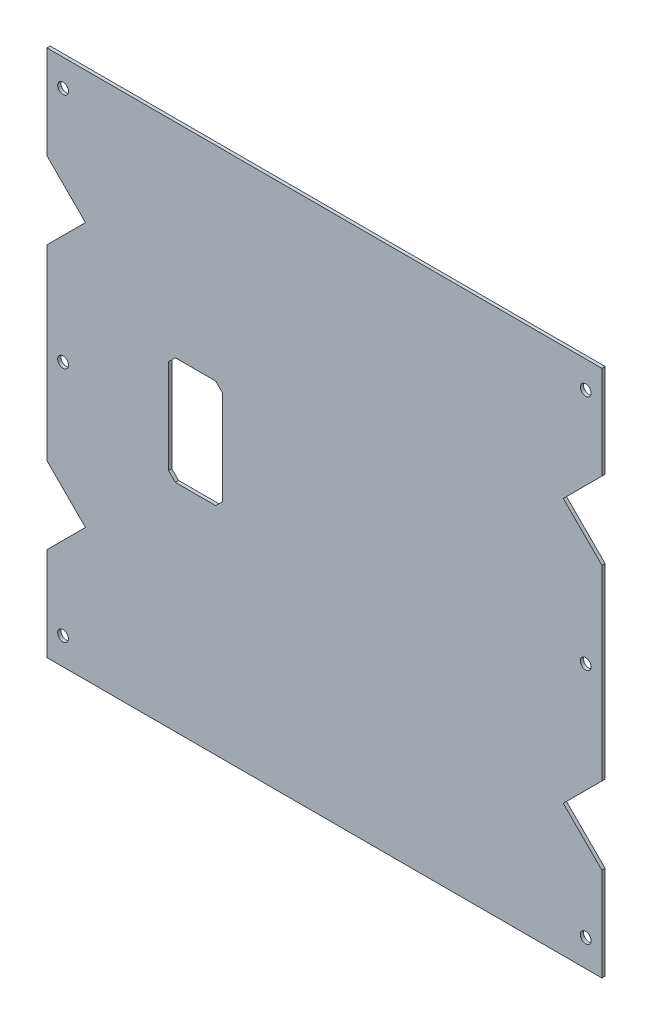
ISO-10303-21;
HEADER;
FILE_DESCRIPTION(('STEP AP214'),'2;1');
FILE_NAME('part.step','',(''),(''),'','','');
FILE_SCHEMA(('AUTOMOTIVE_DESIGN { 1 0 10303 214 1 1 1 1 }'));
ENDSEC;
DATA;
#1=APPLICATION_CONTEXT('core data for automotive mechanical design processes');
#2=APPLICATION_PROTOCOL_DEFINITION('international standard','automotive_design',2000,#1);
#3=PRODUCT_CONTEXT('',#1,'mechanical');
#4=PRODUCT('Part','Part','',(#3));
#5=PRODUCT_RELATED_PRODUCT_CATEGORY('part','',(#4));
#6=PRODUCT_DEFINITION_FORMATION('','',#4);
#7=PRODUCT_DEFINITION_CONTEXT('part definition',#1,'design');
#8=PRODUCT_DEFINITION('design','',#6,#7);
#9=PRODUCT_DEFINITION_SHAPE('','',#8);
#10=(LENGTH_UNIT() NAMED_UNIT(*) SI_UNIT(.MILLI.,.METRE.));
#11=(NAMED_UNIT(*) PLANE_ANGLE_UNIT() SI_UNIT($,.RADIAN.));
#12=(NAMED_UNIT(*) SI_UNIT($,.STERADIAN.) SOLID_ANGLE_UNIT());
#13=UNCERTAINTY_MEASURE_WITH_UNIT(LENGTH_MEASURE(1.E-05),#10,'distance_accuracy_value','');
#14=(GEOMETRIC_REPRESENTATION_CONTEXT(3) GLOBAL_UNCERTAINTY_ASSIGNED_CONTEXT((#13)) GLOBAL_UNIT_ASSIGNED_CONTEXT((#10,
#11,#12)) REPRESENTATION_CONTEXT('',''));
#15=CARTESIAN_POINT('',(0.,0.,0.));
#16=DIRECTION('',(0.,0.,1.));
#17=DIRECTION('',(1.,0.,0.));
#18=AXIS2_PLACEMENT_3D('',#15,#16,#17);
#19=CARTESIAN_POINT('',(0.,0.,-1.2));
#20=DIRECTION('',(0.,0.,1.));
#21=DIRECTION('',(1.,0.,0.));
#22=AXIS2_PLACEMENT_3D('',#19,#20,#21);
#23=PLANE('',#22);
#24=DIRECTION('',(0.707106781186546,0.707106781186549,0.));
#25=VECTOR('',#24,1.);
#26=CARTESIAN_POINT('',(-112.74800186836,24.8232233047034,-1.19999999999988));
#27=LINE('',#26,#25);
#28=CARTESIAN_POINT('',(-102.924778563656,34.6464466094067,-1.19999999999995));
#29=VERTEX_POINT('',#28);
#30=CARTESIAN_POINT('',(-88.6088358912349,48.9623892818283,-1.20000000000005));
#31=VERTEX_POINT('',#30);
#32=EDGE_CURVE('E921',#29,#31,#27,.T.);
#33=ORIENTED_EDGE('',*,*,#32,.T.);
#34=DIRECTION('',(-0.707106781186546,0.707106781186549,0.));
#35=VECTOR('',#34,1.);
#36=CARTESIAN_POINT('',(-112.748001868359,73.1015552589529,-1.19999999999971));
#37=LINE('',#36,#35);
#38=CARTESIAN_POINT('',(-102.924778563656,63.2783319542498,-1.19999999999985));
#39=VERTEX_POINT('',#38);
#40=EDGE_CURVE('E758',#31,#39,#37,.T.);
#41=ORIENTED_EDGE('',*,*,#40,.T.);
#42=DIRECTION('',(0.,1.,0.));
#43=VECTOR('',#42,1.);
#44=CARTESIAN_POINT('',(-102.924778563656,50.1247785636565,-1.19999999999994));
#45=LINE('',#44,#43);
#46=CARTESIAN_POINT('',(-102.924778563656,97.9247785636565,-1.19999999999961));
#47=VERTEX_POINT('',#46);
#48=EDGE_CURVE('E773',#47,#39,#45,.F.);
#49=ORIENTED_EDGE('',*,*,#48,.F.);
#50=DIRECTION('',(1.,0.,0.));
#51=VECTOR('',#50,1.);
#52=CARTESIAN_POINT('',(89.1247785636564,97.9247785636565,-1.19999999999966));
#53=LINE('',#52,#51);
#54=CARTESIAN_POINT('',(102.924778563656,97.9247785636565,-1.19999999999956));
#55=VERTEX_POINT('',#54);
#56=EDGE_CURVE('E794',#55,#47,#53,.F.);
#57=ORIENTED_EDGE('',*,*,#56,.F.);
#58=DIRECTION('',(0.,-1.,0.));
#59=VECTOR('',#58,1.);
#60=CARTESIAN_POINT('',(102.924778563656,97.9247785636565,-1.19999999999956));
#61=LINE('',#60,#59);
#62=CARTESIAN_POINT('',(102.924778563656,63.2783319542498,-1.19999999999981));
#63=VERTEX_POINT('',#62);
#64=EDGE_CURVE('E787',#63,#55,#61,.F.);
#65=ORIENTED_EDGE('',*,*,#64,.F.);
#66=DIRECTION('',(-0.707106781186546,-0.707106781186549,0.));
#67=VECTOR('',#66,1.);
#68=CARTESIAN_POINT('',(112.748001868359,73.1015552589528,-1.19999999999966));
#69=LINE('',#68,#67);
#70=CARTESIAN_POINT('',(88.6088358912349,48.9623892818282,-1.20000000000002));
#71=VERTEX_POINT('',#70);
#72=EDGE_CURVE('E762',#63,#71,#69,.T.);
#73=ORIENTED_EDGE('',*,*,#72,.T.);
#74=DIRECTION('',(0.707106781186547,-0.707106781186549,0.));
#75=VECTOR('',#74,1.);
#76=CARTESIAN_POINT('',(112.74800186836,24.8232233047034,-1.19999999999984));
#77=LINE('',#76,#75);
#78=CARTESIAN_POINT('',(102.924778563656,34.6464466094067,-1.19999999999992));
#79=VERTEX_POINT('',#78);
#80=EDGE_CURVE('E733',#71,#79,#77,.T.);
#81=ORIENTED_EDGE('',*,*,#80,.T.);
#82=DIRECTION('',(0.,-1.,0.));
#83=VECTOR('',#82,1.);
#84=CARTESIAN_POINT('',(102.924778563656,47.8,-1.19999999999991));
#85=LINE('',#84,#83);
#86=CARTESIAN_POINT('',(102.924778563656,-34.6464466094067,-1.1999999999999));
#87=VERTEX_POINT('',#86);
#88=EDGE_CURVE('E811',#87,#79,#85,.F.);
#89=ORIENTED_EDGE('',*,*,#88,.F.);
#90=DIRECTION('',(-0.707106781186546,-0.707106781186549,0.));
#91=VECTOR('',#90,1.);
#92=CARTESIAN_POINT('',(112.74800186836,-24.8232233047034,-1.19999999999985));
#93=LINE('',#92,#91);
#94=CARTESIAN_POINT('',(88.6088358912349,-48.9623892818282,-1.2));
#95=VERTEX_POINT('',#94);
#96=EDGE_CURVE('E728',#87,#95,#93,.T.);
#97=ORIENTED_EDGE('',*,*,#96,.T.);
#98=DIRECTION('',(0.707106781186546,-0.707106781186549,0.));
#99=VECTOR('',#98,1.);
#100=CARTESIAN_POINT('',(112.748001868359,-73.1015552589529,-1.19999999999967));
#101=LINE('',#100,#99);
#102=CARTESIAN_POINT('',(102.924778563656,-63.2783319542498,-1.19999999999982));
#103=VERTEX_POINT('',#102);
#104=EDGE_CURVE('E825',#95,#103,#101,.T.);
#105=ORIENTED_EDGE('',*,*,#104,.T.);
#106=DIRECTION('',(0.,-1.,0.));
#107=VECTOR('',#106,1.);
#108=CARTESIAN_POINT('',(102.924778563656,-50.1247785636564,-1.19999999999991));
#109=LINE('',#108,#107);
#110=CARTESIAN_POINT('',(102.924778563656,-97.9247785636565,-1.19999999999956));
#111=VERTEX_POINT('',#110);
#112=EDGE_CURVE('E833',#111,#103,#109,.F.);
#113=ORIENTED_EDGE('',*,*,#112,.F.);
#114=DIRECTION('',(-1.,0.,0.));
#115=VECTOR('',#114,1.);
#116=CARTESIAN_POINT('',(102.924778563656,-97.9247785636565,-1.19999999999956));
#117=LINE('',#116,#115);
#118=CARTESIAN_POINT('',(-102.924778563656,-97.9247785636565,-1.19999999999955));
#119=VERTEX_POINT('',#118);
#120=EDGE_CURVE('E859',#119,#111,#117,.F.);
#121=ORIENTED_EDGE('',*,*,#120,.F.);
#122=DIRECTION('',(0.,1.,0.));
#123=VECTOR('',#122,1.);
#124=CARTESIAN_POINT('',(-102.924778563656,-97.9247785636565,-1.19999999999955));
#125=LINE('',#124,#123);
#126=CARTESIAN_POINT('',(-102.924778563656,-63.2783319542498,-1.19999999999979));
#127=VERTEX_POINT('',#126);
#128=EDGE_CURVE('E851',#127,#119,#125,.F.);
#129=ORIENTED_EDGE('',*,*,#128,.F.);
#130=DIRECTION('',(0.707106781186546,0.707106781186549,0.));
#131=VECTOR('',#130,1.);
#132=CARTESIAN_POINT('',(-112.748001868359,-73.1015552589528,-1.19999999999965));
#133=LINE('',#132,#131);
#134=CARTESIAN_POINT('',(-88.6088358912349,-48.9623892818282,-1.2));
#135=VERTEX_POINT('',#134);
#136=EDGE_CURVE('E822',#127,#135,#133,.T.);
#137=ORIENTED_EDGE('',*,*,#136,.T.);
#138=DIRECTION('',(-0.707106781186546,0.707106781186549,0.));
#139=VECTOR('',#138,1.);
#140=CARTESIAN_POINT('',(-112.74800186836,-24.8232233047034,-1.19999999999987));
#141=LINE('',#140,#139);
#142=CARTESIAN_POINT('',(-102.924778563656,-34.6464466094067,-1.19999999999992));
#143=VERTEX_POINT('',#142);
#144=EDGE_CURVE('E924',#135,#143,#141,.T.);
#145=ORIENTED_EDGE('',*,*,#144,.T.);
#146=DIRECTION('',(0.,1.,0.));
#147=VECTOR('',#146,1.);
#148=CARTESIAN_POINT('',(-102.924778563656,-47.8,-1.19999999999991));
#149=LINE('',#148,#147);
#150=EDGE_CURVE('E876',#29,#143,#149,.F.);
#151=ORIENTED_EDGE('',*,*,#150,.F.);
#152=EDGE_LOOP('',(#33,#41,#49,#57,#65,#73,#81,#89,#97,#105,#113,#121,#129,#137,#145,#151));
#153=FACE_BOUND('',#152,.T.);
#154=DIRECTION('',(0.,1.,0.));
#155=VECTOR('',#154,1.);
#156=CARTESIAN_POINT('',(-37.8,0.,-1.2));
#157=LINE('',#156,#155);
#158=CARTESIAN_POINT('',(-37.8,-15.3,-1.2));
#159=VERTEX_POINT('',#158);
#160=CARTESIAN_POINT('',(-37.8,19.7,-1.2));
#161=VERTEX_POINT('',#160);
#162=EDGE_CURVE('E552',#159,#161,#157,.T.);
#163=ORIENTED_EDGE('',*,*,#162,.T.);
#164=DIRECTION('',(-0.707106781186548,0.707106781186547,0.));
#165=VECTOR('',#164,1.);
#166=CARTESIAN_POINT('',(-9.04999999999997,-9.04999999999998,-1.2));
#167=LINE('',#166,#165);
#168=CARTESIAN_POINT('',(-40.3,22.2,-1.2));
#169=VERTEX_POINT('',#168);
#170=EDGE_CURVE('E13',#161,#169,#167,.T.);
#171=ORIENTED_EDGE('',*,*,#170,.T.);
#172=DIRECTION('',(-1.,0.,0.));
#173=VECTOR('',#172,1.);
#174=CARTESIAN_POINT('',(0.,22.2,-1.2));
#175=LINE('',#174,#173);
#176=CARTESIAN_POINT('',(-55.3,22.2,-1.2));
#177=VERTEX_POINT('',#176);
#178=EDGE_CURVE('E968',#169,#177,#175,.T.);
#179=ORIENTED_EDGE('',*,*,#178,.T.);
#180=DIRECTION('',(-0.707106781186549,-0.707106781186546,0.));
#181=VECTOR('',#180,1.);
#182=CARTESIAN_POINT('',(-38.7499999999999,38.75,-1.2));
#183=LINE('',#182,#181);
#184=CARTESIAN_POINT('',(-57.8,19.7,-1.2));
#185=VERTEX_POINT('',#184);
#186=EDGE_CURVE('E991',#177,#185,#183,.T.);
#187=ORIENTED_EDGE('',*,*,#186,.T.);
#188=DIRECTION('',(0.,-1.,0.));
#189=VECTOR('',#188,1.);
#190=CARTESIAN_POINT('',(-57.8,0.,-1.2));
#191=LINE('',#190,#189);
#192=CARTESIAN_POINT('',(-57.8,-15.3,-1.2));
#193=VERTEX_POINT('',#192);
#194=EDGE_CURVE('E995',#185,#193,#191,.T.);
#195=ORIENTED_EDGE('',*,*,#194,.T.);
#196=DIRECTION('',(0.707106781186548,-0.707106781186548,0.));
#197=VECTOR('',#196,1.);
#198=CARTESIAN_POINT('',(-36.55,-36.55,-1.2));
#199=LINE('',#198,#197);
#200=CARTESIAN_POINT('',(-55.3,-17.8,-1.2));
#201=VERTEX_POINT('',#200);
#202=EDGE_CURVE('E999',#193,#201,#199,.T.);
#203=ORIENTED_EDGE('',*,*,#202,.T.);
#204=DIRECTION('',(1.,0.,0.));
#205=VECTOR('',#204,1.);
#206=CARTESIAN_POINT('',(0.,-17.8,-1.2));
#207=LINE('',#206,#205);
#208=CARTESIAN_POINT('',(-40.3,-17.8,-1.2));
#209=VERTEX_POINT('',#208);
#210=EDGE_CURVE('E1003',#201,#209,#207,.T.);
#211=ORIENTED_EDGE('',*,*,#210,.T.);
#212=DIRECTION('',(0.707106781186548,0.707106781186548,0.));
#213=VECTOR('',#212,1.);
#214=CARTESIAN_POINT('',(-11.25,11.25,-1.2));
#215=LINE('',#214,#213);
#216=EDGE_CURVE('E1007',#209,#159,#215,.T.);
#217=ORIENTED_EDGE('',*,*,#216,.T.);
#218=EDGE_LOOP('',(#163,#171,#179,#187,#195,#203,#211,#217));
#219=FACE_BOUND('',#218,.T.);
#220=CARTESIAN_POINT('',(-96.924778563657,-1.37574640487224E-13,-1.19999999999998));
#221=DIRECTION('',(0.,0.,-1.));
#222=DIRECTION('',(-1.,0.,0.));
#223=AXIS2_PLACEMENT_3D('',#220,#221,#222);
#224=CIRCLE('',#223,2.);
#225=CARTESIAN_POINT('',(-98.924778563657,-1.3714095961823E-13,-1.19999999999997));
#226=VERTEX_POINT('',#225);
#227=EDGE_CURVE('E928',#226,#226,#224,.T.);
#228=ORIENTED_EDGE('',*,*,#227,.F.);
#229=EDGE_LOOP('',(#228));
#230=FACE_BOUND('',#229,.T.);
#231=CARTESIAN_POINT('',(96.9247785636564,-1.37574640487224E-13,-1.19999999999995));
#232=DIRECTION('',(0.,0.,-1.));
#233=DIRECTION('',(-1.,0.,0.));
#234=AXIS2_PLACEMENT_3D('',#231,#232,#233);
#235=CIRCLE('',#234,2.);
#236=CARTESIAN_POINT('',(94.9247785636564,-1.38008321356218E-13,-1.19999999999996));
#237=VERTEX_POINT('',#236);
#238=EDGE_CURVE('E893',#237,#237,#235,.T.);
#239=ORIENTED_EDGE('',*,*,#238,.F.);
#240=EDGE_LOOP('',(#239));
#241=FACE_BOUND('',#240,.T.);
#242=CARTESIAN_POINT('',(-96.9247785636564,-87.924778563657,-1.19999999999967));
#243=DIRECTION('',(0.,0.,-1.));
#244=DIRECTION('',(-1.,0.,0.));
#245=AXIS2_PLACEMENT_3D('',#242,#243,#244);
#246=CIRCLE('',#245,2.);
#247=CARTESIAN_POINT('',(-98.9247785636564,-87.924778563657,-1.19999999999965));
#248=VERTEX_POINT('',#247);
#249=EDGE_CURVE('E862',#248,#248,#246,.T.);
#250=ORIENTED_EDGE('',*,*,#249,.F.);
#251=EDGE_LOOP('',(#250));
#252=FACE_BOUND('',#251,.T.);
#253=CARTESIAN_POINT('',(96.9247785636564,-87.9247785636565,-1.19999999999965));
#254=DIRECTION('',(0.,0.,-1.));
#255=DIRECTION('',(-1.,0.,0.));
#256=AXIS2_PLACEMENT_3D('',#253,#254,#255);
#257=CIRCLE('',#256,2.);
#258=CARTESIAN_POINT('',(94.9247785636564,-87.9247785636565,-1.19999999999967));
#259=VERTEX_POINT('',#258);
#260=EDGE_CURVE('E753',#259,#259,#257,.T.);
#261=ORIENTED_EDGE('',*,*,#260,.F.);
#262=EDGE_LOOP('',(#261));
#263=FACE_BOUND('',#262,.T.);
#264=CARTESIAN_POINT('',(-96.9247785636566,87.924778563657,-1.19999999999972));
#265=DIRECTION('',(0.,0.,-1.));
#266=DIRECTION('',(1.,0.,0.));
#267=AXIS2_PLACEMENT_3D('',#264,#265,#266);
#268=CIRCLE('',#267,2.);
#269=CARTESIAN_POINT('',(-94.9247785636566,87.9247785636571,-1.19999999999973));
#270=VERTEX_POINT('',#269);
#271=EDGE_CURVE('E790',#270,#270,#268,.T.);
#272=ORIENTED_EDGE('',*,*,#271,.F.);
#273=EDGE_LOOP('',(#272));
#274=FACE_BOUND('',#273,.T.);
#275=CARTESIAN_POINT('',(96.9247785636565,87.9247785636565,-1.19999999999967));
#276=DIRECTION('',(0.,0.,-1.));
#277=DIRECTION('',(1.,0.,0.));
#278=AXIS2_PLACEMENT_3D('',#275,#276,#277);
#279=CIRCLE('',#278,2.);
#280=CARTESIAN_POINT('',(98.9247785636565,87.9247785636565,-1.19999999999965));
#281=VERTEX_POINT('',#280);
#282=EDGE_CURVE('E749',#281,#281,#279,.T.);
#283=ORIENTED_EDGE('',*,*,#282,.F.);
#284=EDGE_LOOP('',(#283));
#285=FACE_BOUND('',#284,.T.);
#286=ADVANCED_FACE('F543',(#153,#219,#230,#241,#252,#263,#274,#285),#23,.F.);
#287=CARTESIAN_POINT('',(0.,0.,0.));
#288=DIRECTION('',(0.,0.,1.));
#289=DIRECTION('',(1.,0.,0.));
#290=AXIS2_PLACEMENT_3D('',#287,#288,#289);
#291=PLANE('',#290);
#292=DIRECTION('',(-0.707106781186546,0.707106781186549,0.));
#293=VECTOR('',#292,1.);
#294=CARTESIAN_POINT('',(-90.1247785636564,50.4783319542497,0.));
#295=LINE('',#294,#293);
#296=CARTESIAN_POINT('',(-88.6088358912349,48.9623892818283,0.));
#297=VERTEX_POINT('',#296);
#298=CARTESIAN_POINT('',(-102.924778563656,63.2783319542498,1.52655665885959E-13));
#299=VERTEX_POINT('',#298);
#300=EDGE_CURVE('E716',#297,#299,#295,.T.);
#301=ORIENTED_EDGE('',*,*,#300,.F.);
#302=DIRECTION('',(0.707106781186546,0.707106781186549,0.));
#303=VECTOR('',#302,1.);
#304=CARTESIAN_POINT('',(-157.837189477156,-20.2659643040926,4.44089209850063E-13));
#305=LINE('',#304,#303);
#306=CARTESIAN_POINT('',(-102.924778563656,34.6464466094067,0.));
#307=VERTEX_POINT('',#306);
#308=EDGE_CURVE('E900',#307,#297,#305,.T.);
#309=ORIENTED_EDGE('',*,*,#308,.F.);
#310=DIRECTION('',(0.,-1.,0.));
#311=VECTOR('',#310,1.);
#312=CARTESIAN_POINT('',(-102.924778563656,0.,0.));
#313=LINE('',#312,#311);
#314=CARTESIAN_POINT('',(-102.924778563656,-34.6464466094067,0.));
#315=VERTEX_POINT('',#314);
#316=EDGE_CURVE('E907',#307,#315,#313,.T.);
#317=ORIENTED_EDGE('',*,*,#316,.T.);
#318=DIRECTION('',(-0.707106781186546,0.707106781186549,0.));
#319=VECTOR('',#318,1.);
#320=CARTESIAN_POINT('',(-90.1247785636564,-47.4464466094067,0.));
#321=LINE('',#320,#319);
#322=CARTESIAN_POINT('',(-88.6088358912349,-48.9623892818282,0.));
#323=VERTEX_POINT('',#322);
#324=EDGE_CURVE('E918',#323,#315,#321,.T.);
#325=ORIENTED_EDGE('',*,*,#324,.F.);
#326=DIRECTION('',(0.707106781186546,0.707106781186549,0.));
#327=VECTOR('',#326,1.);
#328=CARTESIAN_POINT('',(-124.884275797213,-85.2378291878067,5.41233724504764E-13));
#329=LINE('',#328,#327);
#330=CARTESIAN_POINT('',(-102.924778563656,-63.2783319542498,2.15105711021124E-13));
#331=VERTEX_POINT('',#330);
#332=EDGE_CURVE('E815',#331,#323,#329,.T.);
#333=ORIENTED_EDGE('',*,*,#332,.F.);
#334=DIRECTION('',(0.,-1.,0.));
#335=VECTOR('',#334,1.);
#336=CARTESIAN_POINT('',(-102.924778563656,-47.9247785636563,1.04083408558608E-13));
#337=LINE('',#336,#335);
#338=CARTESIAN_POINT('',(-102.924778563656,-97.9247785636565,4.57966997657877E-13));
#339=VERTEX_POINT('',#338);
#340=EDGE_CURVE('E844',#331,#339,#337,.T.);
#341=ORIENTED_EDGE('',*,*,#340,.T.);
#342=DIRECTION('',(1.,0.,0.));
#343=VECTOR('',#342,1.);
#344=CARTESIAN_POINT('',(-137.924778563656,-97.9247785636565,7.21644966006352E-13));
#345=LINE('',#344,#343);
#346=CARTESIAN_POINT('',(102.924778563656,-97.9247785636565,4.44089209850063E-13));
#347=VERTEX_POINT('',#346);
#348=EDGE_CURVE('E841',#339,#347,#345,.T.);
#349=ORIENTED_EDGE('',*,*,#348,.T.);
#350=DIRECTION('',(0.,1.,0.));
#351=VECTOR('',#350,1.);
#352=CARTESIAN_POINT('',(102.924778563656,-47.9247785636563,0.));
#353=LINE('',#352,#351);
#354=CARTESIAN_POINT('',(102.924778563656,-63.2783319542498,1.87350135405495E-13));
#355=VERTEX_POINT('',#354);
#356=EDGE_CURVE('E829',#347,#355,#353,.T.);
#357=ORIENTED_EDGE('',*,*,#356,.T.);
#358=DIRECTION('',(0.707106781186546,-0.707106781186549,0.));
#359=VECTOR('',#358,1.);
#360=CARTESIAN_POINT('',(90.1247785636564,-50.4783319542497,0.));
#361=LINE('',#360,#359);
#362=CARTESIAN_POINT('',(88.6088358912349,-48.9623892818282,0.));
#363=VERTEX_POINT('',#362);
#364=EDGE_CURVE('E812',#363,#355,#361,.T.);
#365=ORIENTED_EDGE('',*,*,#364,.F.);
#366=DIRECTION('',(-0.707106781186546,-0.707106781186549,0.));
#367=VECTOR('',#366,1.);
#368=CARTESIAN_POINT('',(157.837189477156,20.2659643040927,4.71844785465692E-13));
#369=LINE('',#368,#367);
#370=CARTESIAN_POINT('',(102.924778563656,-34.6464466094067,1.11022302462516E-13));
#371=VERTEX_POINT('',#370);
#372=EDGE_CURVE('E873',#371,#363,#369,.T.);
#373=ORIENTED_EDGE('',*,*,#372,.F.);
#374=DIRECTION('',(0.,1.,0.));
#375=VECTOR('',#374,1.);
#376=CARTESIAN_POINT('',(102.924778563656,0.,0.));
#377=LINE('',#376,#375);
#378=CARTESIAN_POINT('',(102.924778563656,34.6464466094067,0.));
#379=VERTEX_POINT('',#378);
#380=EDGE_CURVE('E723',#371,#379,#377,.T.);
#381=ORIENTED_EDGE('',*,*,#380,.T.);
#382=DIRECTION('',(0.707106781186547,-0.707106781186549,0.));
#383=VECTOR('',#382,1.);
#384=CARTESIAN_POINT('',(90.1247785636564,47.4464466094067,0.));
#385=LINE('',#384,#383);
#386=CARTESIAN_POINT('',(88.6088358912349,48.9623892818282,0.));
#387=VERTEX_POINT('',#386);
#388=EDGE_CURVE('E719',#387,#379,#385,.T.);
#389=ORIENTED_EDGE('',*,*,#388,.F.);
#390=DIRECTION('',(-0.707106781186546,-0.707106781186549,0.));
#391=VECTOR('',#390,1.);
#392=CARTESIAN_POINT('',(124.884275797213,85.2378291878067,5.27355936696949E-13));
#393=LINE('',#392,#391);
#394=CARTESIAN_POINT('',(102.924778563656,63.2783319542498,2.0122792321331E-13));
#395=VERTEX_POINT('',#394);
#396=EDGE_CURVE('E706',#395,#387,#393,.T.);
#397=ORIENTED_EDGE('',*,*,#396,.F.);
#398=DIRECTION('',(0.,1.,0.));
#399=VECTOR('',#398,1.);
#400=CARTESIAN_POINT('',(102.924778563656,47.9247785636563,0.));
#401=LINE('',#400,#399);
#402=CARTESIAN_POINT('',(102.924778563656,97.9247785636565,4.44089209850063E-13));
#403=VERTEX_POINT('',#402);
#404=EDGE_CURVE('E784',#395,#403,#401,.T.);
#405=ORIENTED_EDGE('',*,*,#404,.T.);
#406=DIRECTION('',(-1.,0.,0.));
#407=VECTOR('',#406,1.);
#408=CARTESIAN_POINT('',(137.924778563656,97.9247785636565,7.07767178198537E-13));
#409=LINE('',#408,#407);
#410=CARTESIAN_POINT('',(-102.924778563656,97.9247785636565,3.95516952522712E-13));
#411=VERTEX_POINT('',#410);
#412=EDGE_CURVE('E781',#403,#411,#409,.T.);
#413=ORIENTED_EDGE('',*,*,#412,.T.);
#414=DIRECTION('',(0.,-1.,0.));
#415=VECTOR('',#414,1.);
#416=CARTESIAN_POINT('',(-102.924778563656,47.9247785636563,0.));
#417=LINE('',#416,#415);
#418=EDGE_CURVE('E765',#411,#299,#417,.T.);
#419=ORIENTED_EDGE('',*,*,#418,.T.);
#420=EDGE_LOOP('',(#301,#309,#317,#325,#333,#341,#349,#357,#365,#373,#381,#389,#397,#405,#413,#419));
#421=FACE_BOUND('',#420,.T.);
#422=DIRECTION('',(-0.707106781186548,0.707106781186547,0.));
#423=VECTOR('',#422,1.);
#424=CARTESIAN_POINT('',(-37.8,19.7,0.));
#425=LINE('',#424,#423);
#426=CARTESIAN_POINT('',(-37.8,19.7,0.));
#427=VERTEX_POINT('',#426);
#428=CARTESIAN_POINT('',(-40.3,22.2,0.));
#429=VERTEX_POINT('',#428);
#430=EDGE_CURVE('E567',#427,#429,#425,.T.);
#431=ORIENTED_EDGE('',*,*,#430,.F.);
#432=DIRECTION('',(0.,1.,0.));
#433=VECTOR('',#432,1.);
#434=CARTESIAN_POINT('',(-37.8,-15.3,0.));
#435=LINE('',#434,#433);
#436=CARTESIAN_POINT('',(-37.8,-15.3,0.));
#437=VERTEX_POINT('',#436);
#438=EDGE_CURVE('E960',#437,#427,#435,.T.);
#439=ORIENTED_EDGE('',*,*,#438,.F.);
#440=DIRECTION('',(0.707106781186547,0.707106781186547,0.));
#441=VECTOR('',#440,1.);
#442=CARTESIAN_POINT('',(-37.8,-15.3,0.));
#443=LINE('',#442,#441);
#444=CARTESIAN_POINT('',(-40.3,-17.8,0.));
#445=VERTEX_POINT('',#444);
#446=EDGE_CURVE('E956',#445,#437,#443,.T.);
#447=ORIENTED_EDGE('',*,*,#446,.F.);
#448=DIRECTION('',(1.,0.,0.));
#449=VECTOR('',#448,1.);
#450=CARTESIAN_POINT('',(-40.3,-17.8,0.));
#451=LINE('',#450,#449);
#452=CARTESIAN_POINT('',(-55.3,-17.8,0.));
#453=VERTEX_POINT('',#452);
#454=EDGE_CURVE('E952',#453,#445,#451,.T.);
#455=ORIENTED_EDGE('',*,*,#454,.F.);
#456=DIRECTION('',(0.707106781186547,-0.707106781186547,0.));
#457=VECTOR('',#456,1.);
#458=CARTESIAN_POINT('',(-55.3,-17.8,0.));
#459=LINE('',#458,#457);
#460=CARTESIAN_POINT('',(-57.8,-15.3,0.));
#461=VERTEX_POINT('',#460);
#462=EDGE_CURVE('E948',#461,#453,#459,.T.);
#463=ORIENTED_EDGE('',*,*,#462,.F.);
#464=DIRECTION('',(0.,-1.,0.));
#465=VECTOR('',#464,1.);
#466=CARTESIAN_POINT('',(-57.8,-15.3,0.));
#467=LINE('',#466,#465);
#468=CARTESIAN_POINT('',(-57.8,19.7,0.));
#469=VERTEX_POINT('',#468);
#470=EDGE_CURVE('E944',#469,#461,#467,.T.);
#471=ORIENTED_EDGE('',*,*,#470,.F.);
#472=DIRECTION('',(-0.707106781186549,-0.707106781186546,0.));
#473=VECTOR('',#472,1.);
#474=CARTESIAN_POINT('',(-55.3,22.2,0.));
#475=LINE('',#474,#473);
#476=CARTESIAN_POINT('',(-55.3,22.2,0.));
#477=VERTEX_POINT('',#476);
#478=EDGE_CURVE('E940',#477,#469,#475,.T.);
#479=ORIENTED_EDGE('',*,*,#478,.F.);
#480=DIRECTION('',(-1.,0.,0.));
#481=VECTOR('',#480,1.);
#482=CARTESIAN_POINT('',(-40.3,22.2,0.));
#483=LINE('',#482,#481);
#484=EDGE_CURVE('E937',#429,#477,#483,.T.);
#485=ORIENTED_EDGE('',*,*,#484,.F.);
#486=EDGE_LOOP('',(#431,#439,#447,#455,#463,#471,#479,#485));
#487=FACE_BOUND('',#486,.T.);
#488=CARTESIAN_POINT('',(-96.924778563657,-1.37314431965828E-13,0.));
#489=DIRECTION('',(0.,0.,-1.));
#490=DIRECTION('',(-1.,0.,0.));
#491=AXIS2_PLACEMENT_3D('',#488,#489,#490);
#492=CIRCLE('',#491,2.);
#493=CARTESIAN_POINT('',(-98.924778563657,-1.36880751096833E-13,0.));
#494=VERTEX_POINT('',#493);
#495=EDGE_CURVE('E911',#494,#494,#492,.T.);
#496=ORIENTED_EDGE('',*,*,#495,.T.);
#497=EDGE_LOOP('',(#496));
#498=FACE_BOUND('',#497,.T.);
#499=CARTESIAN_POINT('',(96.9247785636564,-1.37314431965827E-13,0.));
#500=DIRECTION('',(0.,0.,1.));
#501=DIRECTION('',(1.,0.,0.));
#502=AXIS2_PLACEMENT_3D('',#499,#500,#501);
#503=CIRCLE('',#502,2.);
#504=CARTESIAN_POINT('',(98.9247785636564,-1.36880751096833E-13,0.));
#505=VERTEX_POINT('',#504);
#506=EDGE_CURVE('E889',#505,#505,#503,.T.);
#507=ORIENTED_EDGE('',*,*,#506,.F.);
#508=EDGE_LOOP('',(#507));
#509=FACE_BOUND('',#508,.T.);
#510=CARTESIAN_POINT('',(96.9247785636564,-87.9247785636565,4.23272528138341E-13));
#511=DIRECTION('',(0.,0.,1.));
#512=DIRECTION('',(0.,-1.,0.));
#513=AXIS2_PLACEMENT_3D('',#510,#511,#512);
#514=CIRCLE('',#513,2.);
#515=CARTESIAN_POINT('',(96.9247785636564,-89.9247785636565,4.43228205505941E-13));
#516=VERTEX_POINT('',#515);
#517=EDGE_CURVE('E866',#516,#516,#514,.T.);
#518=ORIENTED_EDGE('',*,*,#517,.F.);
#519=EDGE_LOOP('',(#518));
#520=FACE_BOUND('',#519,.T.);
#521=CARTESIAN_POINT('',(-96.9247785636564,-87.924778563657,3.40005801291454E-13));
#522=DIRECTION('',(0.,0.,-1.));
#523=DIRECTION('',(-1.,0.,0.));
#524=AXIS2_PLACEMENT_3D('',#521,#522,#523);
#525=CIRCLE('',#524,2.);
#526=CARTESIAN_POINT('',(-98.9247785636564,-87.924778563657,3.55033858350482E-13));
#527=VERTEX_POINT('',#526);
#528=EDGE_CURVE('E847',#527,#527,#525,.T.);
#529=ORIENTED_EDGE('',*,*,#528,.T.);
#530=EDGE_LOOP('',(#529));
#531=FACE_BOUND('',#530,.T.);
#532=CARTESIAN_POINT('',(-96.9247785636566,87.924778563657,2.91433543964104E-13));
#533=DIRECTION('',(0.,0.,-1.));
#534=DIRECTION('',(1.,0.,0.));
#535=AXIS2_PLACEMENT_3D('',#532,#533,#534);
#536=CIRCLE('',#535,2.);
#537=CARTESIAN_POINT('',(-94.9247785636566,87.9247785636571,2.78416760500411E-13));
#538=VERTEX_POINT('',#537);
#539=EDGE_CURVE('E769',#538,#538,#536,.T.);
#540=ORIENTED_EDGE('',*,*,#539,.T.);
#541=EDGE_LOOP('',(#540));
#542=FACE_BOUND('',#541,.T.);
#543=CARTESIAN_POINT('',(96.9247785636565,87.9247785636565,4.09394740330526E-13));
#544=DIRECTION('',(0.,0.,1.));
#545=DIRECTION('',(0.,1.,0.));
#546=AXIS2_PLACEMENT_3D('',#543,#544,#545);
#547=CIRCLE('',#546,2.);
#548=CARTESIAN_POINT('',(96.9247785636565,89.9247785636565,4.29350417698126E-13));
#549=VERTEX_POINT('',#548);
#550=EDGE_CURVE('E801',#549,#549,#547,.T.);
#551=ORIENTED_EDGE('',*,*,#550,.F.);
#552=EDGE_LOOP('',(#551));
#553=FACE_BOUND('',#552,.T.);
#554=ADVANCED_FACE('F545',(#421,#487,#498,#509,#520,#531,#542,#553),#291,.T.);
#555=CARTESIAN_POINT('',(-37.8,19.7,-10.));
#556=DIRECTION('',(0.707106781186547,0.707106781186548,0.));
#557=DIRECTION('',(-0.707106781186548,0.707106781186547,0.));
#558=AXIS2_PLACEMENT_3D('',#555,#556,#557);
#559=PLANE('',#558);
#560=DIRECTION('',(0.,0.,1.));
#561=VECTOR('',#560,1.);
#562=CARTESIAN_POINT('',(-37.8,19.7,-10.));
#563=LINE('',#562,#561);
#564=EDGE_CURVE('E965',#161,#427,#563,.T.);
#565=ORIENTED_EDGE('',*,*,#564,.T.);
#566=ORIENTED_EDGE('',*,*,#430,.T.);
#567=DIRECTION('',(0.,0.,1.));
#568=VECTOR('',#567,1.);
#569=CARTESIAN_POINT('',(-40.3,22.2,-10.));
#570=LINE('',#569,#568);
#571=EDGE_CURVE('E964',#169,#429,#570,.T.);
#572=ORIENTED_EDGE('',*,*,#571,.F.);
#573=ORIENTED_EDGE('',*,*,#170,.F.);
#574=EDGE_LOOP('',(#565,#566,#572,#573));
#575=FACE_BOUND('',#574,.T.);
#576=ADVANCED_FACE('F1029',(#575),#559,.F.);
#577=CARTESIAN_POINT('',(-37.8,-15.3,-10.));
#578=DIRECTION('',(1.,0.,0.));
#579=DIRECTION('',(0.,0.,-1.));
#580=AXIS2_PLACEMENT_3D('',#577,#578,#579);
#581=PLANE('',#580);
#582=DIRECTION('',(0.,0.,1.));
#583=VECTOR('',#582,1.);
#584=CARTESIAN_POINT('',(-37.8,-15.3,-10.));
#585=LINE('',#584,#583);
#586=EDGE_CURVE('E969',#159,#437,#585,.T.);
#587=ORIENTED_EDGE('',*,*,#586,.T.);
#588=ORIENTED_EDGE('',*,*,#438,.T.);
#589=ORIENTED_EDGE('',*,*,#564,.F.);
#590=ORIENTED_EDGE('',*,*,#162,.F.);
#591=EDGE_LOOP('',(#587,#588,#589,#590));
#592=FACE_BOUND('',#591,.T.);
#593=ADVANCED_FACE('F1017',(#592),#581,.F.);
#594=CARTESIAN_POINT('',(-37.8,-15.3,-10.));
#595=DIRECTION('',(0.707106781186548,-0.707106781186548,0.));
#596=DIRECTION('',(0.707106781186548,0.707106781186548,0.));
#597=AXIS2_PLACEMENT_3D('',#594,#595,#596);
#598=PLANE('',#597);
#599=DIRECTION('',(0.,0.,1.));
#600=VECTOR('',#599,1.);
#601=CARTESIAN_POINT('',(-40.3,-17.8,-10.));
#602=LINE('',#601,#600);
#603=EDGE_CURVE('E972',#209,#445,#602,.T.);
#604=ORIENTED_EDGE('',*,*,#603,.T.);
#605=ORIENTED_EDGE('',*,*,#446,.T.);
#606=ORIENTED_EDGE('',*,*,#586,.F.);
#607=ORIENTED_EDGE('',*,*,#216,.F.);
#608=EDGE_LOOP('',(#604,#605,#606,#607));
#609=FACE_BOUND('',#608,.T.);
#610=ADVANCED_FACE('F1019',(#609),#598,.F.);
#611=CARTESIAN_POINT('',(-40.3,-17.8,-10.));
#612=DIRECTION('',(0.,-1.,0.));
#613=DIRECTION('',(1.,0.,0.));
#614=AXIS2_PLACEMENT_3D('',#611,#612,#613);
#615=PLANE('',#614);
#616=DIRECTION('',(0.,0.,1.));
#617=VECTOR('',#616,1.);
#618=CARTESIAN_POINT('',(-55.3,-17.8,-10.));
#619=LINE('',#618,#617);
#620=EDGE_CURVE('E975',#201,#453,#619,.T.);
#621=ORIENTED_EDGE('',*,*,#620,.T.);
#622=ORIENTED_EDGE('',*,*,#454,.T.);
#623=ORIENTED_EDGE('',*,*,#603,.F.);
#624=ORIENTED_EDGE('',*,*,#210,.F.);
#625=EDGE_LOOP('',(#621,#622,#623,#624));
#626=FACE_BOUND('',#625,.T.);
#627=ADVANCED_FACE('F1140',(#626),#615,.F.);
#628=CARTESIAN_POINT('',(-55.3,-17.8,-10.));
#629=DIRECTION('',(-0.707106781186548,-0.707106781186548,0.));
#630=DIRECTION('',(0.707106781186548,-0.707106781186548,0.));
#631=AXIS2_PLACEMENT_3D('',#628,#629,#630);
#632=PLANE('',#631);
#633=DIRECTION('',(0.,0.,1.));
#634=VECTOR('',#633,1.);
#635=CARTESIAN_POINT('',(-57.8,-15.3,-10.));
#636=LINE('',#635,#634);
#637=EDGE_CURVE('E978',#193,#461,#636,.T.);
#638=ORIENTED_EDGE('',*,*,#637,.T.);
#639=ORIENTED_EDGE('',*,*,#462,.T.);
#640=ORIENTED_EDGE('',*,*,#620,.F.);
#641=ORIENTED_EDGE('',*,*,#202,.F.);
#642=EDGE_LOOP('',(#638,#639,#640,#641));
#643=FACE_BOUND('',#642,.T.);
#644=ADVANCED_FACE('F1143',(#643),#632,.F.);
#645=CARTESIAN_POINT('',(-57.8,-15.3,-10.));
#646=DIRECTION('',(-1.,0.,0.));
#647=DIRECTION('',(0.,0.,1.));
#648=AXIS2_PLACEMENT_3D('',#645,#646,#647);
#649=PLANE('',#648);
#650=DIRECTION('',(0.,0.,1.));
#651=VECTOR('',#650,1.);
#652=CARTESIAN_POINT('',(-57.8,19.7,-10.));
#653=LINE('',#652,#651);
#654=EDGE_CURVE('E981',#185,#469,#653,.T.);
#655=ORIENTED_EDGE('',*,*,#654,.T.);
#656=ORIENTED_EDGE('',*,*,#470,.T.);
#657=ORIENTED_EDGE('',*,*,#637,.F.);
#658=ORIENTED_EDGE('',*,*,#194,.F.);
#659=EDGE_LOOP('',(#655,#656,#657,#658));
#660=FACE_BOUND('',#659,.T.);
#661=ADVANCED_FACE('F1147',(#660),#649,.F.);
#662=CARTESIAN_POINT('',(-55.3,22.2,-10.));
#663=DIRECTION('',(-0.707106781186546,0.707106781186549,0.));
#664=DIRECTION('',(-0.707106781186549,-0.707106781186546,0.));
#665=AXIS2_PLACEMENT_3D('',#662,#663,#664);
#666=PLANE('',#665);
#667=DIRECTION('',(0.,0.,1.));
#668=VECTOR('',#667,1.);
#669=CARTESIAN_POINT('',(-55.3,22.2,-10.));
#670=LINE('',#669,#668);
#671=EDGE_CURVE('E559',#177,#477,#670,.T.);
#672=ORIENTED_EDGE('',*,*,#671,.T.);
#673=ORIENTED_EDGE('',*,*,#478,.T.);
#674=ORIENTED_EDGE('',*,*,#654,.F.);
#675=ORIENTED_EDGE('',*,*,#186,.F.);
#676=EDGE_LOOP('',(#672,#673,#674,#675));
#677=FACE_BOUND('',#676,.T.);
#678=ADVANCED_FACE('F1151',(#677),#666,.F.);
#679=CARTESIAN_POINT('',(-40.3,22.2,-10.));
#680=DIRECTION('',(0.,1.,0.));
#681=DIRECTION('',(-1.,0.,0.));
#682=AXIS2_PLACEMENT_3D('',#679,#680,#681);
#683=PLANE('',#682);
#684=ORIENTED_EDGE('',*,*,#571,.T.);
#685=ORIENTED_EDGE('',*,*,#484,.T.);
#686=ORIENTED_EDGE('',*,*,#671,.F.);
#687=ORIENTED_EDGE('',*,*,#178,.F.);
#688=EDGE_LOOP('',(#684,#685,#686,#687));
#689=FACE_BOUND('',#688,.T.);
#690=ADVANCED_FACE('F1028',(#689),#683,.F.);
#691=CARTESIAN_POINT('',(-102.924778563656,-47.8,0.));
#692=DIRECTION('',(1.,0.,0.));
#693=DIRECTION('',(0.,0.,-1.));
#694=AXIS2_PLACEMENT_3D('',#691,#692,#693);
#695=PLANE('',#694);
#696=DIRECTION('',(0.,0.,-1.));
#697=VECTOR('',#696,1.);
#698=CARTESIAN_POINT('',(-102.924778563656,-34.6464466094067,0.));
#699=LINE('',#698,#697);
#700=EDGE_CURVE('E915',#315,#143,#699,.T.);
#701=ORIENTED_EDGE('',*,*,#700,.F.);
#702=ORIENTED_EDGE('',*,*,#316,.F.);
#703=DIRECTION('',(0.,0.,1.));
#704=VECTOR('',#703,1.);
#705=CARTESIAN_POINT('',(-102.924778563656,34.6464466094067,0.));
#706=LINE('',#705,#704);
#707=EDGE_CURVE('E903',#29,#307,#706,.T.);
#708=ORIENTED_EDGE('',*,*,#707,.F.);
#709=ORIENTED_EDGE('',*,*,#150,.T.);
#710=EDGE_LOOP('',(#701,#702,#708,#709));
#711=FACE_BOUND('',#710,.T.);
#712=ADVANCED_FACE('F1124',(#711),#695,.F.);
#713=CARTESIAN_POINT('',(-96.9247785636569,-1.28640814585944E-13,40.0000000000001));
#714=DIRECTION('',(0.,0.,-1.));
#715=DIRECTION('',(-1.,0.,0.));
#716=AXIS2_PLACEMENT_3D('',#713,#714,#715);
#717=CYLINDRICAL_SURFACE('',#716,2.);
#718=ORIENTED_EDGE('',*,*,#227,.T.);
#719=EDGE_LOOP('',(#718));
#720=FACE_BOUND('',#719,.T.);
#721=ORIENTED_EDGE('',*,*,#495,.F.);
#722=EDGE_LOOP('',(#721));
#723=FACE_BOUND('',#722,.T.);
#724=ADVANCED_FACE('F1127',(#720,#723),#717,.F.);
#725=CARTESIAN_POINT('',(-90.1247785636564,-47.4464466094067,0.));
#726=DIRECTION('',(-0.707106781186549,-0.707106781186546,0.));
#727=DIRECTION('',(-0.707106781186546,0.707106781186549,0.));
#728=AXIS2_PLACEMENT_3D('',#725,#726,#727);
#729=PLANE('',#728);
#730=ORIENTED_EDGE('',*,*,#144,.F.);
#731=DIRECTION('',(0.,0.,-1.));
#732=VECTOR('',#731,1.);
#733=CARTESIAN_POINT('',(-88.6088358912349,-48.9623892818282,0.));
#734=LINE('',#733,#732);
#735=EDGE_CURVE('E739',#323,#135,#734,.T.);
#736=ORIENTED_EDGE('',*,*,#735,.F.);
#737=ORIENTED_EDGE('',*,*,#324,.T.);
#738=ORIENTED_EDGE('',*,*,#700,.T.);
#739=EDGE_LOOP('',(#730,#736,#737,#738));
#740=FACE_BOUND('',#739,.T.);
#741=ADVANCED_FACE('F1131',(#740),#729,.T.);
#742=CARTESIAN_POINT('',(-157.837189477156,-20.2659643040926,4.44089209850063E-13));
#743=DIRECTION('',(-0.707106781186549,0.707106781186547,0.));
#744=DIRECTION('',(0.707106781186546,0.707106781186549,0.));
#745=AXIS2_PLACEMENT_3D('',#742,#743,#744);
#746=PLANE('',#745);
#747=ORIENTED_EDGE('',*,*,#32,.F.);
#748=ORIENTED_EDGE('',*,*,#707,.T.);
#749=ORIENTED_EDGE('',*,*,#308,.T.);
#750=DIRECTION('',(0.,0.,-1.));
#751=VECTOR('',#750,1.);
#752=CARTESIAN_POINT('',(-88.6088358912349,48.9623892818283,0.));
#753=LINE('',#752,#751);
#754=EDGE_CURVE('E745',#297,#31,#753,.T.);
#755=ORIENTED_EDGE('',*,*,#754,.T.);
#756=EDGE_LOOP('',(#747,#748,#749,#755));
#757=FACE_BOUND('',#756,.T.);
#758=ADVANCED_FACE('F1051',(#757),#746,.T.);
#759=CARTESIAN_POINT('',(102.924778563656,47.8,0.));
#760=DIRECTION('',(-1.,0.,0.));
#761=DIRECTION('',(0.,0.,1.));
#762=AXIS2_PLACEMENT_3D('',#759,#760,#761);
#763=PLANE('',#762);
#764=DIRECTION('',(0.,0.,-1.));
#765=VECTOR('',#764,1.);
#766=CARTESIAN_POINT('',(102.924778563656,34.6464466094067,0.));
#767=LINE('',#766,#765);
#768=EDGE_CURVE('E727',#379,#79,#767,.T.);
#769=ORIENTED_EDGE('',*,*,#768,.F.);
#770=ORIENTED_EDGE('',*,*,#380,.F.);
#771=DIRECTION('',(0.,0.,1.));
#772=VECTOR('',#771,1.);
#773=CARTESIAN_POINT('',(102.924778563656,-34.6464466094067,0.));
#774=LINE('',#773,#772);
#775=EDGE_CURVE('E877',#87,#371,#774,.T.);
#776=ORIENTED_EDGE('',*,*,#775,.F.);
#777=ORIENTED_EDGE('',*,*,#88,.T.);
#778=EDGE_LOOP('',(#769,#770,#776,#777));
#779=FACE_BOUND('',#778,.T.);
#780=ADVANCED_FACE('F1111',(#779),#763,.F.);
#781=CARTESIAN_POINT('',(96.9247785636578,-1.8501932755519E-13,-220.));
#782=DIRECTION('',(0.,0.,1.));
#783=DIRECTION('',(1.,0.,0.));
#784=AXIS2_PLACEMENT_3D('',#781,#782,#783);
#785=CYLINDRICAL_SURFACE('',#784,2.);
#786=ORIENTED_EDGE('',*,*,#238,.T.);
#787=EDGE_LOOP('',(#786));
#788=FACE_BOUND('',#787,.T.);
#789=ORIENTED_EDGE('',*,*,#506,.T.);
#790=EDGE_LOOP('',(#789));
#791=FACE_BOUND('',#790,.T.);
#792=ADVANCED_FACE('F1114',(#788,#791),#785,.F.);
#793=CARTESIAN_POINT('',(90.1247785636564,47.4464466094067,0.));
#794=DIRECTION('',(0.707106781186549,0.707106781186547,0.));
#795=DIRECTION('',(-0.707106781186547,0.707106781186549,0.));
#796=AXIS2_PLACEMENT_3D('',#793,#794,#795);
#797=PLANE('',#796);
#798=ORIENTED_EDGE('',*,*,#80,.F.);
#799=DIRECTION('',(0.,0.,-1.));
#800=VECTOR('',#799,1.);
#801=CARTESIAN_POINT('',(88.6088358912349,48.9623892818282,0.));
#802=LINE('',#801,#800);
#803=EDGE_CURVE('E711',#387,#71,#802,.T.);
#804=ORIENTED_EDGE('',*,*,#803,.F.);
#805=ORIENTED_EDGE('',*,*,#388,.T.);
#806=ORIENTED_EDGE('',*,*,#768,.T.);
#807=EDGE_LOOP('',(#798,#804,#805,#806));
#808=FACE_BOUND('',#807,.T.);
#809=ADVANCED_FACE('F731',(#808),#797,.T.);
#810=CARTESIAN_POINT('',(157.837189477156,20.2659643040927,4.71844785465692E-13));
#811=DIRECTION('',(0.707106781186549,-0.707106781186546,0.));
#812=DIRECTION('',(0.707106781186546,0.707106781186549,0.));
#813=AXIS2_PLACEMENT_3D('',#810,#811,#812);
#814=PLANE('',#813);
#815=ORIENTED_EDGE('',*,*,#96,.F.);
#816=ORIENTED_EDGE('',*,*,#775,.T.);
#817=ORIENTED_EDGE('',*,*,#372,.T.);
#818=DIRECTION('',(0.,0.,-1.));
#819=VECTOR('',#818,1.);
#820=CARTESIAN_POINT('',(88.6088358912349,-48.9623892818282,0.));
#821=LINE('',#820,#819);
#822=EDGE_CURVE('E735',#363,#95,#821,.T.);
#823=ORIENTED_EDGE('',*,*,#822,.T.);
#824=EDGE_LOOP('',(#815,#816,#817,#823));
#825=FACE_BOUND('',#824,.T.);
#826=ADVANCED_FACE('F1085',(#825),#814,.T.);
#827=CARTESIAN_POINT('',(96.9247785636572,-87.9247785636587,-220.));
#828=DIRECTION('',(0.,0.,1.));
#829=DIRECTION('',(0.,-1.,0.));
#830=AXIS2_PLACEMENT_3D('',#827,#828,#829);
#831=CYLINDRICAL_SURFACE('',#830,2.);
#832=ORIENTED_EDGE('',*,*,#260,.T.);
#833=EDGE_LOOP('',(#832));
#834=FACE_BOUND('',#833,.T.);
#835=ORIENTED_EDGE('',*,*,#517,.T.);
#836=EDGE_LOOP('',(#835));
#837=FACE_BOUND('',#836,.T.);
#838=ADVANCED_FACE('F1081',(#834,#837),#831,.F.);
#839=CARTESIAN_POINT('',(-96.9247785636563,-87.9247785636569,40.0000000000003));
#840=DIRECTION('',(0.,0.,-1.));
#841=DIRECTION('',(0.,-1.,0.));
#842=AXIS2_PLACEMENT_3D('',#839,#840,#841);
#843=CYLINDRICAL_SURFACE('',#842,2.);
#844=ORIENTED_EDGE('',*,*,#249,.T.);
#845=EDGE_LOOP('',(#844));
#846=FACE_BOUND('',#845,.T.);
#847=ORIENTED_EDGE('',*,*,#528,.F.);
#848=EDGE_LOOP('',(#847));
#849=FACE_BOUND('',#848,.T.);
#850=ADVANCED_FACE('F1084',(#846,#849),#843,.F.);
#851=CARTESIAN_POINT('',(102.924778563656,-97.9247785636565,4.44089209850063E-13));
#852=DIRECTION('',(0.,1.,0.));
#853=DIRECTION('',(-1.,0.,0.));
#854=AXIS2_PLACEMENT_3D('',#851,#852,#853);
#855=PLANE('',#854);
#856=DIRECTION('',(0.,0.,-1.));
#857=VECTOR('',#856,1.);
#858=CARTESIAN_POINT('',(102.924778563656,-97.9247785636565,4.44089209850063E-13));
#859=LINE('',#858,#857);
#860=EDGE_CURVE('E837',#347,#111,#859,.T.);
#861=ORIENTED_EDGE('',*,*,#860,.F.);
#862=ORIENTED_EDGE('',*,*,#348,.F.);
#863=DIRECTION('',(0.,0.,-1.));
#864=VECTOR('',#863,1.);
#865=CARTESIAN_POINT('',(-102.924778563656,-97.9247785636565,4.57966997657877E-13));
#866=LINE('',#865,#864);
#867=EDGE_CURVE('E855',#339,#119,#866,.T.);
#868=ORIENTED_EDGE('',*,*,#867,.T.);
#869=ORIENTED_EDGE('',*,*,#120,.T.);
#870=EDGE_LOOP('',(#861,#862,#868,#869));
#871=FACE_BOUND('',#870,.T.);
#872=ADVANCED_FACE('F1089',(#871),#855,.F.);
#873=CARTESIAN_POINT('',(-102.924778563656,-97.9247785636565,4.57966997657877E-13));
#874=DIRECTION('',(1.,0.,0.));
#875=DIRECTION('',(0.,-1.,0.));
#876=AXIS2_PLACEMENT_3D('',#873,#874,#875);
#877=PLANE('',#876);
#878=DIRECTION('',(0.,0.,1.));
#879=VECTOR('',#878,1.);
#880=CARTESIAN_POINT('',(-102.924778563656,-63.2783319542498,2.28983498828939E-13));
#881=LINE('',#880,#879);
#882=EDGE_CURVE('E818',#127,#331,#881,.T.);
#883=ORIENTED_EDGE('',*,*,#882,.F.);
#884=ORIENTED_EDGE('',*,*,#128,.T.);
#885=ORIENTED_EDGE('',*,*,#867,.F.);
#886=ORIENTED_EDGE('',*,*,#340,.F.);
#887=EDGE_LOOP('',(#883,#884,#885,#886));
#888=FACE_BOUND('',#887,.T.);
#889=ADVANCED_FACE('F1093',(#888),#877,.F.);
#890=CARTESIAN_POINT('',(102.924778563656,-50.1247785636564,0.));
#891=DIRECTION('',(-1.,0.,0.));
#892=DIRECTION('',(0.,-1.,0.));
#893=AXIS2_PLACEMENT_3D('',#890,#891,#892);
#894=PLANE('',#893);
#895=DIRECTION('',(0.,0.,-1.));
#896=VECTOR('',#895,1.);
#897=CARTESIAN_POINT('',(102.924778563656,-63.2783319542498,2.0122792321331E-13));
#898=LINE('',#897,#896);
#899=EDGE_CURVE('E808',#355,#103,#898,.T.);
#900=ORIENTED_EDGE('',*,*,#899,.F.);
#901=ORIENTED_EDGE('',*,*,#356,.F.);
#902=ORIENTED_EDGE('',*,*,#860,.T.);
#903=ORIENTED_EDGE('',*,*,#112,.T.);
#904=EDGE_LOOP('',(#900,#901,#902,#903));
#905=FACE_BOUND('',#904,.T.);
#906=ADVANCED_FACE('F1097',(#905),#894,.F.);
#907=CARTESIAN_POINT('',(-124.884275797213,-85.2378291878067,5.41233724504764E-13));
#908=DIRECTION('',(-0.707106781186549,0.707106781186546,0.));
#909=DIRECTION('',(0.707106781186546,0.707106781186549,0.));
#910=AXIS2_PLACEMENT_3D('',#907,#908,#909);
#911=PLANE('',#910);
#912=ORIENTED_EDGE('',*,*,#136,.F.);
#913=ORIENTED_EDGE('',*,*,#882,.T.);
#914=ORIENTED_EDGE('',*,*,#332,.T.);
#915=ORIENTED_EDGE('',*,*,#735,.T.);
#916=EDGE_LOOP('',(#912,#913,#914,#915));
#917=FACE_BOUND('',#916,.T.);
#918=ADVANCED_FACE('F1101',(#917),#911,.T.);
#919=CARTESIAN_POINT('',(90.1247785636564,-50.4783319542497,0.));
#920=DIRECTION('',(0.707106781186549,0.707106781186546,0.));
#921=DIRECTION('',(-0.707106781186546,0.707106781186549,0.));
#922=AXIS2_PLACEMENT_3D('',#919,#920,#921);
#923=PLANE('',#922);
#924=ORIENTED_EDGE('',*,*,#104,.F.);
#925=ORIENTED_EDGE('',*,*,#822,.F.);
#926=ORIENTED_EDGE('',*,*,#364,.T.);
#927=ORIENTED_EDGE('',*,*,#899,.T.);
#928=EDGE_LOOP('',(#924,#925,#926,#927));
#929=FACE_BOUND('',#928,.T.);
#930=ADVANCED_FACE('F1105',(#929),#923,.T.);
#931=CARTESIAN_POINT('',(96.9247785636573,87.9247785636587,-220.));
#932=DIRECTION('',(0.,0.,1.));
#933=DIRECTION('',(0.,1.,0.));
#934=AXIS2_PLACEMENT_3D('',#931,#932,#933);
#935=CYLINDRICAL_SURFACE('',#934,2.);
#936=ORIENTED_EDGE('',*,*,#282,.T.);
#937=EDGE_LOOP('',(#936));
#938=FACE_BOUND('',#937,.T.);
#939=ORIENTED_EDGE('',*,*,#550,.T.);
#940=EDGE_LOOP('',(#939));
#941=FACE_BOUND('',#940,.T.);
#942=ADVANCED_FACE('F1109',(#938,#941),#935,.F.);
#943=CARTESIAN_POINT('',(89.1247785636564,97.9247785636565,3.46944695195361E-13));
#944=DIRECTION('',(0.,-1.,0.));
#945=DIRECTION('',(1.,0.,0.));
#946=AXIS2_PLACEMENT_3D('',#943,#944,#945);
#947=PLANE('',#946);
#948=ORIENTED_EDGE('',*,*,#56,.T.);
#949=DIRECTION('',(0.,0.,-1.));
#950=VECTOR('',#949,1.);
#951=CARTESIAN_POINT('',(-102.924778563656,97.9247785636565,3.95516952522712E-13));
#952=LINE('',#951,#950);
#953=EDGE_CURVE('E777',#411,#47,#952,.T.);
#954=ORIENTED_EDGE('',*,*,#953,.F.);
#955=ORIENTED_EDGE('',*,*,#412,.F.);
#956=DIRECTION('',(0.,0.,-1.));
#957=VECTOR('',#956,1.);
#958=CARTESIAN_POINT('',(102.924778563656,97.9247785636565,4.44089209850063E-13));
#959=LINE('',#958,#957);
#960=EDGE_CURVE('E797',#403,#55,#959,.T.);
#961=ORIENTED_EDGE('',*,*,#960,.T.);
#962=EDGE_LOOP('',(#948,#954,#955,#961));
#963=FACE_BOUND('',#962,.T.);
#964=ADVANCED_FACE('F1060',(#963),#947,.F.);
#965=CARTESIAN_POINT('',(-96.9247785636564,87.9247785636569,40.0000000000003));
#966=DIRECTION('',(0.,0.,-1.));
#967=DIRECTION('',(0.,1.,0.));
#968=AXIS2_PLACEMENT_3D('',#965,#966,#967);
#969=CYLINDRICAL_SURFACE('',#968,2.);
#970=ORIENTED_EDGE('',*,*,#271,.T.);
#971=EDGE_LOOP('',(#970));
#972=FACE_BOUND('',#971,.T.);
#973=ORIENTED_EDGE('',*,*,#539,.F.);
#974=EDGE_LOOP('',(#973));
#975=FACE_BOUND('',#974,.T.);
#976=ADVANCED_FACE('F1066',(#972,#975),#969,.F.);
#977=CARTESIAN_POINT('',(102.924778563656,97.9247785636565,4.44089209850063E-13));
#978=DIRECTION('',(-1.,0.,0.));
#979=DIRECTION('',(0.,-1.,0.));
#980=AXIS2_PLACEMENT_3D('',#977,#978,#979);
#981=PLANE('',#980);
#982=DIRECTION('',(0.,0.,1.));
#983=VECTOR('',#982,1.);
#984=CARTESIAN_POINT('',(102.924778563656,63.2783319542498,2.15105711021124E-13));
#985=LINE('',#984,#983);
#986=EDGE_CURVE('E712',#63,#395,#985,.T.);
#987=ORIENTED_EDGE('',*,*,#986,.F.);
#988=ORIENTED_EDGE('',*,*,#64,.T.);
#989=ORIENTED_EDGE('',*,*,#960,.F.);
#990=ORIENTED_EDGE('',*,*,#404,.F.);
#991=EDGE_LOOP('',(#987,#988,#989,#990));
#992=FACE_BOUND('',#991,.T.);
#993=ADVANCED_FACE('F1064',(#992),#981,.F.);
#994=CARTESIAN_POINT('',(-102.924778563656,50.1247785636564,0.));
#995=DIRECTION('',(1.,0.,0.));
#996=DIRECTION('',(0.,-1.,0.));
#997=AXIS2_PLACEMENT_3D('',#994,#995,#996);
#998=PLANE('',#997);
#999=DIRECTION('',(0.,0.,-1.));
#1000=VECTOR('',#999,1.);
#1001=CARTESIAN_POINT('',(-102.924778563656,63.2783319542498,1.52655665885959E-13));
#1002=LINE('',#1001,#1000);
#1003=EDGE_CURVE('E750',#299,#39,#1002,.T.);
#1004=ORIENTED_EDGE('',*,*,#1003,.F.);
#1005=ORIENTED_EDGE('',*,*,#418,.F.);
#1006=ORIENTED_EDGE('',*,*,#953,.T.);
#1007=ORIENTED_EDGE('',*,*,#48,.T.);
#1008=EDGE_LOOP('',(#1004,#1005,#1006,#1007));
#1009=FACE_BOUND('',#1008,.T.);
#1010=ADVANCED_FACE('F1055',(#1009),#998,.F.);
#1011=CARTESIAN_POINT('',(124.884275797213,85.2378291878067,5.27355936696949E-13));
#1012=DIRECTION('',(0.707106781186549,-0.707106781186546,0.));
#1013=DIRECTION('',(0.707106781186546,0.707106781186549,0.));
#1014=AXIS2_PLACEMENT_3D('',#1011,#1012,#1013);
#1015=PLANE('',#1014);
#1016=ORIENTED_EDGE('',*,*,#72,.F.);
#1017=ORIENTED_EDGE('',*,*,#986,.T.);
#1018=ORIENTED_EDGE('',*,*,#396,.T.);
#1019=ORIENTED_EDGE('',*,*,#803,.T.);
#1020=EDGE_LOOP('',(#1016,#1017,#1018,#1019));
#1021=FACE_BOUND('',#1020,.T.);
#1022=ADVANCED_FACE('F709',(#1021),#1015,.T.);
#1023=CARTESIAN_POINT('',(-90.1247785636564,50.4783319542497,0.));
#1024=DIRECTION('',(-0.707106781186549,-0.707106781186546,0.));
#1025=DIRECTION('',(-0.707106781186546,0.707106781186549,0.));
#1026=AXIS2_PLACEMENT_3D('',#1023,#1024,#1025);
#1027=PLANE('',#1026);
#1028=ORIENTED_EDGE('',*,*,#40,.F.);
#1029=ORIENTED_EDGE('',*,*,#754,.F.);
#1030=ORIENTED_EDGE('',*,*,#300,.T.);
#1031=ORIENTED_EDGE('',*,*,#1003,.T.);
#1032=EDGE_LOOP('',(#1028,#1029,#1030,#1031));
#1033=FACE_BOUND('',#1032,.T.);
#1034=ADVANCED_FACE('F1049',(#1033),#1027,.T.);
#1035=CLOSED_SHELL('',(#286,#554,#576,#593,#610,#627,#644,#661,#678,#690,#712,#724,#741,#758,
#780,#792,#809,#826,#838,#850,#872,#889,#906,#918,#930,#942,#964,#976,#993,#1010,#1022,#1034));
#1036=MANIFOLD_SOLID_BREP('B2',#1035);
#1037=ADVANCED_BREP_SHAPE_REPRESENTATION('',(#18,#1036),#14);
#1038=SHAPE_DEFINITION_REPRESENTATION(#9,#1037);
ENDSEC;
END-ISO-10303-21;
